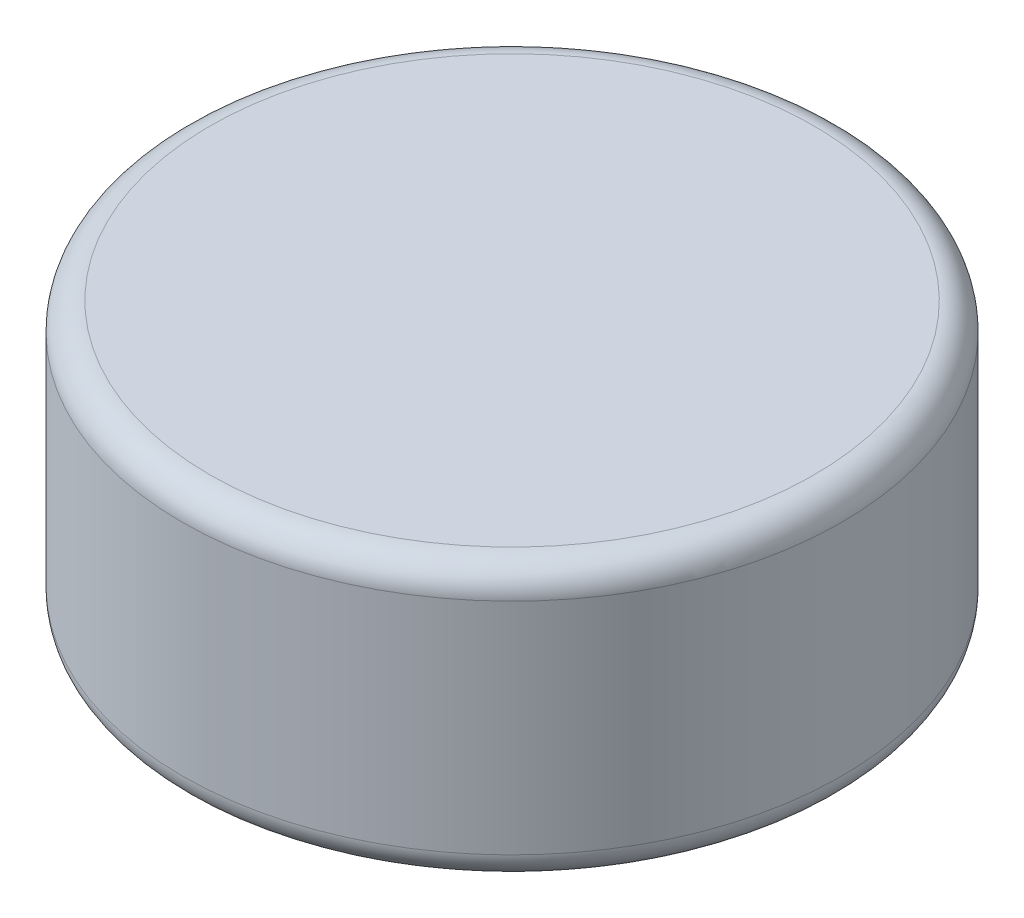
ISO-10303-21;
HEADER;
FILE_DESCRIPTION(('STEP AP214'),'2;1');
FILE_NAME('part.step','',(''),(''),'','','');
FILE_SCHEMA(('AUTOMOTIVE_DESIGN { 1 0 10303 214 1 1 1 1 }'));
ENDSEC;
DATA;
#1=APPLICATION_CONTEXT('core data for automotive mechanical design processes');
#2=APPLICATION_PROTOCOL_DEFINITION('international standard','automotive_design',2000,#1);
#3=PRODUCT_CONTEXT('',#1,'mechanical');
#4=PRODUCT('Part','Part','',(#3));
#5=PRODUCT_RELATED_PRODUCT_CATEGORY('part','',(#4));
#6=PRODUCT_DEFINITION_FORMATION('','',#4);
#7=PRODUCT_DEFINITION_CONTEXT('part definition',#1,'design');
#8=PRODUCT_DEFINITION('design','',#6,#7);
#9=PRODUCT_DEFINITION_SHAPE('','',#8);
#10=(LENGTH_UNIT() NAMED_UNIT(*) SI_UNIT(.MILLI.,.METRE.));
#11=(NAMED_UNIT(*) PLANE_ANGLE_UNIT() SI_UNIT($,.RADIAN.));
#12=(NAMED_UNIT(*) SI_UNIT($,.STERADIAN.) SOLID_ANGLE_UNIT());
#13=UNCERTAINTY_MEASURE_WITH_UNIT(LENGTH_MEASURE(1.E-05),#10,'distance_accuracy_value','');
#14=(GEOMETRIC_REPRESENTATION_CONTEXT(3) GLOBAL_UNCERTAINTY_ASSIGNED_CONTEXT((#13)) GLOBAL_UNIT_ASSIGNED_CONTEXT((#10,
#11,#12)) REPRESENTATION_CONTEXT('',''));
#15=CARTESIAN_POINT('',(0.,0.,0.));
#16=DIRECTION('',(0.,0.,1.));
#17=DIRECTION('',(1.,0.,0.));
#18=AXIS2_PLACEMENT_3D('',#15,#16,#17);
#19=CARTESIAN_POINT('',(0.,2.5,0.));
#20=DIRECTION('',(0.,-1.,0.));
#21=DIRECTION('',(0.,0.,-1.));
#22=AXIS2_PLACEMENT_3D('',#19,#20,#21);
#23=CYLINDRICAL_SURFACE('',#22,3.);
#24=CARTESIAN_POINT('',(0.,2.25,0.));
#25=DIRECTION('',(0.,1.,0.));
#26=DIRECTION('',(0.,0.,1.));
#27=AXIS2_PLACEMENT_3D('',#24,#25,#26);
#28=CIRCLE('',#27,3.);
#29=CARTESIAN_POINT('',(0.,2.25,3.));
#30=VERTEX_POINT('',#29);
#31=EDGE_CURVE('E45',#30,#30,#28,.F.);
#32=ORIENTED_EDGE('',*,*,#31,.T.);
#33=EDGE_LOOP('',(#32));
#34=FACE_BOUND('',#33,.T.);
#35=CARTESIAN_POINT('',(0.,0.25,0.));
#36=DIRECTION('',(0.,1.,0.));
#37=DIRECTION('',(0.,0.,1.));
#38=AXIS2_PLACEMENT_3D('',#35,#36,#37);
#39=CIRCLE('',#38,3.);
#40=CARTESIAN_POINT('',(0.,0.25,3.));
#41=VERTEX_POINT('',#40);
#42=EDGE_CURVE('E50',#41,#41,#39,.T.);
#43=ORIENTED_EDGE('',*,*,#42,.T.);
#44=EDGE_LOOP('',(#43));
#45=FACE_BOUND('',#44,.T.);
#46=ADVANCED_FACE('F37',(#34,#45),#23,.T.);
#47=CARTESIAN_POINT('',(0.,2.5,0.));
#48=DIRECTION('',(0.,1.,0.));
#49=DIRECTION('',(0.,0.,1.));
#50=AXIS2_PLACEMENT_3D('',#47,#48,#49);
#51=PLANE('',#50);
#52=CARTESIAN_POINT('',(0.,2.5,0.));
#53=DIRECTION('',(0.,1.,0.));
#54=DIRECTION('',(0.,0.,1.));
#55=AXIS2_PLACEMENT_3D('',#52,#53,#54);
#56=CIRCLE('',#55,2.75);
#57=CARTESIAN_POINT('',(0.,2.5,2.75));
#58=VERTEX_POINT('',#57);
#59=EDGE_CURVE('E55',#58,#58,#56,.T.);
#60=ORIENTED_EDGE('',*,*,#59,.T.);
#61=EDGE_LOOP('',(#60));
#62=FACE_BOUND('',#61,.T.);
#63=ADVANCED_FACE('F62',(#62),#51,.T.);
#64=CARTESIAN_POINT('',(0.,0.,0.));
#65=DIRECTION('',(0.,1.,0.));
#66=DIRECTION('',(0.,0.,1.));
#67=AXIS2_PLACEMENT_3D('',#64,#65,#66);
#68=PLANE('',#67);
#69=CARTESIAN_POINT('',(0.,0.,0.));
#70=DIRECTION('',(0.,1.,0.));
#71=DIRECTION('',(0.,0.,1.));
#72=AXIS2_PLACEMENT_3D('',#69,#70,#71);
#73=CIRCLE('',#72,2.75);
#74=CARTESIAN_POINT('',(0.,0.,2.75));
#75=VERTEX_POINT('',#74);
#76=EDGE_CURVE('E10',#75,#75,#73,.F.);
#77=ORIENTED_EDGE('',*,*,#76,.T.);
#78=EDGE_LOOP('',(#77));
#79=FACE_BOUND('',#78,.T.);
#80=ADVANCED_FACE('F66',(#79),#68,.F.);
#81=CARTESIAN_POINT('',(0.,2.25,0.));
#82=DIRECTION('',(0.,1.,0.));
#83=DIRECTION('',(0.,0.,1.));
#84=AXIS2_PLACEMENT_3D('',#81,#82,#83);
#85=TOROIDAL_SURFACE('',#84,2.75,0.25);
#86=ORIENTED_EDGE('',*,*,#31,.F.);
#87=EDGE_LOOP('',(#86));
#88=FACE_BOUND('',#87,.T.);
#89=ORIENTED_EDGE('',*,*,#59,.F.);
#90=EDGE_LOOP('',(#89));
#91=FACE_BOUND('',#90,.T.);
#92=ADVANCED_FACE('F64',(#88,#91),#85,.T.);
#93=CARTESIAN_POINT('',(0.,0.25,0.));
#94=DIRECTION('',(0.,1.,0.));
#95=DIRECTION('',(0.,0.,1.));
#96=AXIS2_PLACEMENT_3D('',#93,#94,#95);
#97=TOROIDAL_SURFACE('',#96,2.75,0.25);
#98=ORIENTED_EDGE('',*,*,#76,.F.);
#99=EDGE_LOOP('',(#98));
#100=FACE_BOUND('',#99,.T.);
#101=ORIENTED_EDGE('',*,*,#42,.F.);
#102=EDGE_LOOP('',(#101));
#103=FACE_BOUND('',#102,.T.);
#104=ADVANCED_FACE('F39',(#100,#103),#97,.T.);
#105=CLOSED_SHELL('',(#46,#63,#80,#92,#104));
#106=MANIFOLD_SOLID_BREP('B2',#105);
#107=ADVANCED_BREP_SHAPE_REPRESENTATION('',(#18,#106),#14);
#108=SHAPE_DEFINITION_REPRESENTATION(#9,#107);
ENDSEC;
END-ISO-10303-21;
